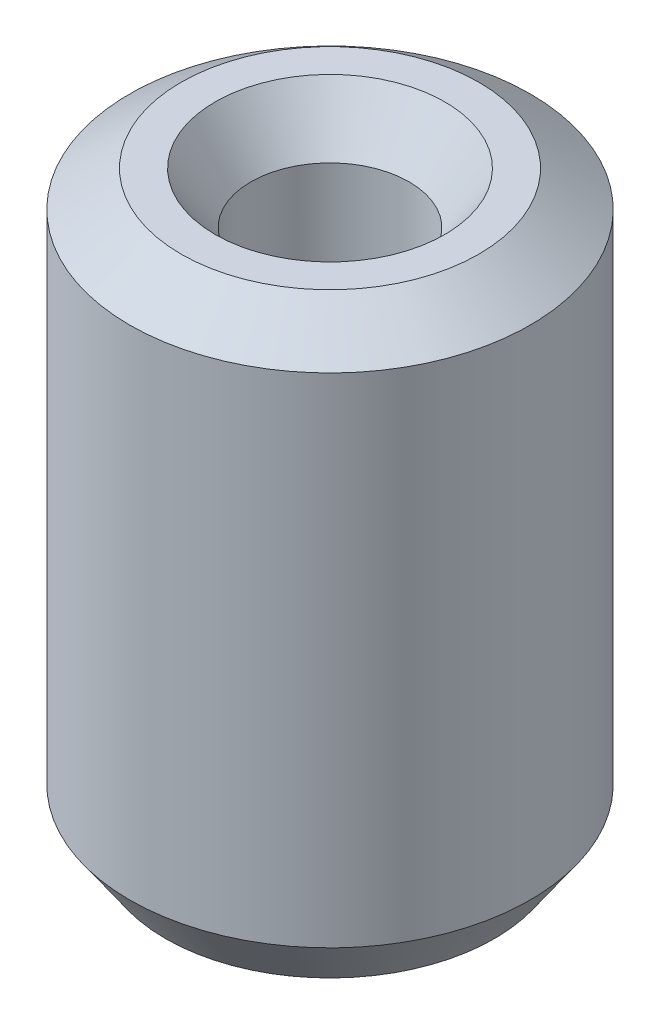
ISO-10303-21;
HEADER;
FILE_DESCRIPTION(('STEP AP214'),'2;1');
FILE_NAME('part.step','',(''),(''),'','','');
FILE_SCHEMA(('AUTOMOTIVE_DESIGN { 1 0 10303 214 1 1 1 1 }'));
ENDSEC;
DATA;
#1=APPLICATION_CONTEXT('core data for automotive mechanical design processes');
#2=APPLICATION_PROTOCOL_DEFINITION('international standard','automotive_design',2000,#1);
#3=PRODUCT_CONTEXT('',#1,'mechanical');
#4=PRODUCT('Part','Part','',(#3));
#5=PRODUCT_RELATED_PRODUCT_CATEGORY('part','',(#4));
#6=PRODUCT_DEFINITION_FORMATION('','',#4);
#7=PRODUCT_DEFINITION_CONTEXT('part definition',#1,'design');
#8=PRODUCT_DEFINITION('design','',#6,#7);
#9=PRODUCT_DEFINITION_SHAPE('','',#8);
#10=(LENGTH_UNIT() NAMED_UNIT(*) SI_UNIT(.MILLI.,.METRE.));
#11=(NAMED_UNIT(*) PLANE_ANGLE_UNIT() SI_UNIT($,.RADIAN.));
#12=(NAMED_UNIT(*) SI_UNIT($,.STERADIAN.) SOLID_ANGLE_UNIT());
#13=UNCERTAINTY_MEASURE_WITH_UNIT(LENGTH_MEASURE(1.E-05),#10,'distance_accuracy_value','');
#14=(GEOMETRIC_REPRESENTATION_CONTEXT(3) GLOBAL_UNCERTAINTY_ASSIGNED_CONTEXT((#13)) GLOBAL_UNIT_ASSIGNED_CONTEXT((#10,
#11,#12)) REPRESENTATION_CONTEXT('',''));
#15=CARTESIAN_POINT('',(0.,0.,0.));
#16=DIRECTION('',(0.,0.,1.));
#17=DIRECTION('',(1.,0.,0.));
#18=AXIS2_PLACEMENT_3D('',#15,#16,#17);
#19=CARTESIAN_POINT('',(0.,29.2128205983832,0.));
#20=DIRECTION('',(0.,-1.,0.));
#21=DIRECTION('',(0.,0.,-1.));
#22=AXIS2_PLACEMENT_3D('',#19,#20,#21);
#23=CYLINDRICAL_SURFACE('',#22,10.);
#24=CARTESIAN_POINT('',(0.,2.5648094755214,0.));
#25=DIRECTION('',(0.,1.,0.));
#26=DIRECTION('',(0.,0.,1.));
#27=AXIS2_PLACEMENT_3D('',#24,#25,#26);
#28=CIRCLE('',#27,10.);
#29=CARTESIAN_POINT('',(0.,2.5648094755214,-10.));
#30=VERTEX_POINT('',#29);
#31=EDGE_CURVE('E10',#30,#30,#28,.T.);
#32=CARTESIAN_POINT('',(0.,27.4273046035939,0.));
#33=DIRECTION('',(0.,1.,0.));
#34=DIRECTION('',(0.,0.,1.));
#35=AXIS2_PLACEMENT_3D('',#32,#33,#34);
#36=CIRCLE('',#35,10.);
#37=CARTESIAN_POINT('',(0.,27.4273046035939,-10.));
#38=VERTEX_POINT('',#37);
#39=EDGE_CURVE('E50',#38,#38,#36,.F.);
#40=CARTESIAN_POINT('',(0.,2.5648094755214,-10.));
#41=CARTESIAN_POINT('',(0.,2.82379379977216,-10.));
#42=CARTESIAN_POINT('',(0.,3.08277812402291,-10.));
#43=CARTESIAN_POINT('',(0.,3.60074677252442,-10.));
#44=CARTESIAN_POINT('',(0.,3.85973109677518,-10.));
#45=CARTESIAN_POINT('',(0.,4.37769974527669,-10.));
#46=CARTESIAN_POINT('',(0.,4.63668406952744,-10.));
#47=CARTESIAN_POINT('',(0.,5.15465271802895,-10.));
#48=CARTESIAN_POINT('',(0.,5.41363704227971,-10.));
#49=CARTESIAN_POINT('',(0.,5.93160569078122,-10.));
#50=CARTESIAN_POINT('',(0.,6.19059001503198,-10.));
#51=CARTESIAN_POINT('',(0.,6.70855866353349,-10.));
#52=CARTESIAN_POINT('',(0.,6.96754298778424,-10.));
#53=CARTESIAN_POINT('',(0.,7.48551163628575,-10.));
#54=CARTESIAN_POINT('',(0.,7.74449596053651,-10.));
#55=CARTESIAN_POINT('',(0.,8.26246460903802,-10.));
#56=CARTESIAN_POINT('',(0.,8.52144893328877,-10.));
#57=CARTESIAN_POINT('',(0.,9.03941758179028,-10.));
#58=CARTESIAN_POINT('',(0.,9.29840190604104,-10.));
#59=CARTESIAN_POINT('',(0.,9.81637055454255,-10.));
#60=CARTESIAN_POINT('',(0.,10.0753548787933,-10.));
#61=CARTESIAN_POINT('',(0.,10.5933235272948,-10.));
#62=CARTESIAN_POINT('',(0.,10.8523078515456,-10.));
#63=CARTESIAN_POINT('',(0.,11.3702765000471,-10.));
#64=CARTESIAN_POINT('',(0.,11.6292608242978,-10.));
#65=CARTESIAN_POINT('',(0.,12.1472294727993,-10.));
#66=CARTESIAN_POINT('',(0.,12.4062137970501,-10.));
#67=CARTESIAN_POINT('',(0.,12.9241824455516,-10.));
#68=CARTESIAN_POINT('',(0.,13.1831667698024,-10.));
#69=CARTESIAN_POINT('',(0.,13.7011354183039,-10.));
#70=CARTESIAN_POINT('',(0.,13.9601197425546,-10.));
#71=CARTESIAN_POINT('',(0.,14.4780883910561,-10.));
#72=CARTESIAN_POINT('',(0.,14.7370727153069,-10.));
#73=CARTESIAN_POINT('',(0.,15.2550413638084,-10.));
#74=CARTESIAN_POINT('',(0.,15.5140256880592,-10.));
#75=CARTESIAN_POINT('',(0.,16.0319943365607,-10.));
#76=CARTESIAN_POINT('',(0.,16.2909786608114,-10.));
#77=CARTESIAN_POINT('',(0.,16.8089473093129,-10.));
#78=CARTESIAN_POINT('',(0.,17.0679316335637,-10.));
#79=CARTESIAN_POINT('',(0.,17.5859002820652,-10.));
#80=CARTESIAN_POINT('',(0.,17.844884606316,-10.));
#81=CARTESIAN_POINT('',(0.,18.3628532548175,-10.));
#82=CARTESIAN_POINT('',(0.,18.6218375790682,-10.));
#83=CARTESIAN_POINT('',(0.,19.1398062275697,-10.));
#84=CARTESIAN_POINT('',(0.,19.3987905518205,-10.));
#85=CARTESIAN_POINT('',(0.,19.916759200322,-10.));
#86=CARTESIAN_POINT('',(0.,20.1757435245728,-10.));
#87=CARTESIAN_POINT('',(0.,20.6937121730743,-10.));
#88=CARTESIAN_POINT('',(0.,20.952696497325,-10.));
#89=CARTESIAN_POINT('',(0.,21.4706651458265,-10.));
#90=CARTESIAN_POINT('',(0.,21.7296494700773,-10.));
#91=CARTESIAN_POINT('',(0.,22.2476181185788,-10.));
#92=CARTESIAN_POINT('',(0.,22.5066024428296,-10.));
#93=CARTESIAN_POINT('',(0.,23.0245710913311,-10.));
#94=CARTESIAN_POINT('',(0.,23.2835554155818,-10.));
#95=CARTESIAN_POINT('',(0.,23.8015240640833,-10.));
#96=CARTESIAN_POINT('',(0.,24.0605083883341,-10.));
#97=CARTESIAN_POINT('',(0.,24.5784770368356,-10.));
#98=CARTESIAN_POINT('',(0.,24.8374613610864,-10.));
#99=CARTESIAN_POINT('',(0.,25.3554300095879,-10.));
#100=CARTESIAN_POINT('',(0.,25.6144143338386,-10.));
#101=CARTESIAN_POINT('',(0.,26.1323829823401,-10.));
#102=CARTESIAN_POINT('',(0.,26.3913673065909,-10.));
#103=CARTESIAN_POINT('',(0.,26.9093359550924,-10.));
#104=CARTESIAN_POINT('',(0.,27.1683202793432,-10.));
#105=CARTESIAN_POINT('',(0.,27.4273046035939,-10.));
#106=B_SPLINE_CURVE_WITH_KNOTS('',3,(#40,#41,#42,#43,#44,#45,#46,#47,#48,#49,#50,#51,#52,#53,
#54,#55,#56,#57,#58,#59,#60,#61,#62,#63,#64,#65,#66,#67,#68,#69,#70,#71,#72,#73,#74,#75,#76,#77,
#78,#79,#80,#81,#82,#83,#84,#85,#86,#87,#88,#89,#90,#91,#92,#93,#94,#95,#96,#97,#98,#99,#100,
#101,#102,#103,#104,#105),.UNSPECIFIED.,.F.,.F.,(4,2,2,2,2,2,2,2,2,2,2,2,2,2,2,2,2,2,2,2,2,2,2,
2,2,2,2,2,2,2,2,2,4),(0.,0.776952972752265,1.55390594550453,2.3308589182568,3.10781189100906,
3.88476486376133,4.6617178365136,5.43867080926586,6.21562378201813,6.99257675477039,
7.76952972752266,8.54648270027493,9.32343567302719,10.1003886457795,10.8773416185317,
11.654294591284,12.4312475640363,13.2082005367885,13.9851535095408,14.762106482293,
15.5390594550453,16.3160124277976,17.0929654005499,17.8699183733021,18.6468713460544,
19.4238243188066,20.2007772915589,20.9777302643112,21.7546832370634,22.5316362098157,
23.308589182568,24.0855421553202,24.8624951280725),.UNSPECIFIED.);
#107=EDGE_CURVE('BSEAM39',#30,#38,#106,.T.);
#108=ORIENTED_EDGE('',*,*,#31,.T.);
#109=ORIENTED_EDGE('',*,*,#39,.T.);
#110=ORIENTED_EDGE('',*,*,#107,.T.);
#111=ORIENTED_EDGE('',*,*,#107,.F.);
#112=EDGE_LOOP('',(#108,#110,#109,#111));
#113=FACE_BOUND('',#112,.T.);
#114=ADVANCED_FACE('F39',(#113),#23,.T.);
#115=CARTESIAN_POINT('',(0.,29.2128205983832,0.));
#116=DIRECTION('',(0.,1.,0.));
#117=DIRECTION('',(0.,0.,1.));
#118=AXIS2_PLACEMENT_3D('',#115,#116,#117);
#119=PLANE('',#118);
#120=CARTESIAN_POINT('',(0.,29.2128205983832,0.));
#121=DIRECTION('',(0.,1.,0.));
#122=DIRECTION('',(0.,0.,1.));
#123=AXIS2_PLACEMENT_3D('',#120,#121,#122);
#124=CIRCLE('',#123,5.73672593289727);
#125=CARTESIAN_POINT('',(0.,29.2128205983832,5.73672593289727));
#126=VERTEX_POINT('',#125);
#127=EDGE_CURVE('E58',#126,#126,#124,.F.);
#128=ORIENTED_EDGE('',*,*,#127,.T.);
#129=EDGE_LOOP('',(#128));
#130=FACE_BOUND('',#129,.T.);
#131=CARTESIAN_POINT('',(0.,29.2128205983832,0.));
#132=DIRECTION('',(0.,1.,0.));
#133=DIRECTION('',(0.,0.,1.));
#134=AXIS2_PLACEMENT_3D('',#131,#132,#133);
#135=CIRCLE('',#134,7.43519052447868);
#136=CARTESIAN_POINT('',(0.,29.2128205983832,7.43519052447868));
#137=VERTEX_POINT('',#136);
#138=EDGE_CURVE('E61',#137,#137,#135,.T.);
#139=ORIENTED_EDGE('',*,*,#138,.T.);
#140=EDGE_LOOP('',(#139));
#141=FACE_BOUND('',#140,.T.);
#142=ADVANCED_FACE('F88',(#130,#141),#119,.T.);
#143=CARTESIAN_POINT('',(0.,0.,0.));
#144=DIRECTION('',(0.,1.,0.));
#145=DIRECTION('',(0.,0.,1.));
#146=AXIS2_PLACEMENT_3D('',#143,#144,#145);
#147=PLANE('',#146);
#148=CARTESIAN_POINT('',(0.,0.,0.));
#149=DIRECTION('',(0.,1.,0.));
#150=DIRECTION('',(0.,0.,1.));
#151=AXIS2_PLACEMENT_3D('',#148,#149,#150);
#152=CIRCLE('',#151,6.51601941362921);
#153=CARTESIAN_POINT('',(0.,0.,6.51601941362921));
#154=VERTEX_POINT('',#153);
#155=EDGE_CURVE('E51',#154,#154,#152,.T.);
#156=ORIENTED_EDGE('',*,*,#155,.T.);
#157=EDGE_LOOP('',(#156));
#158=FACE_BOUND('',#157,.T.);
#159=CARTESIAN_POINT('',(0.,0.,0.));
#160=DIRECTION('',(0.,1.,0.));
#161=DIRECTION('',(0.,0.,1.));
#162=AXIS2_PLACEMENT_3D('',#159,#160,#161);
#163=CIRCLE('',#162,8.2144840052106);
#164=CARTESIAN_POINT('',(0.,0.,8.2144840052106));
#165=VERTEX_POINT('',#164);
#166=EDGE_CURVE('E54',#165,#165,#163,.F.);
#167=ORIENTED_EDGE('',*,*,#166,.T.);
#168=EDGE_LOOP('',(#167));
#169=FACE_BOUND('',#168,.T.);
#170=ADVANCED_FACE('F83',(#158,#169),#147,.F.);
#171=CARTESIAN_POINT('',(0.,29.2128205983832,0.));
#172=DIRECTION('',(0.,-1.,0.));
#173=DIRECTION('',(0.,0.,-1.));
#174=AXIS2_PLACEMENT_3D('',#171,#172,#173);
#175=CYLINDRICAL_SURFACE('',#174,3.95120993810789);
#176=CARTESIAN_POINT('',(0.,26.6480111228619,0.));
#177=DIRECTION('',(0.,1.,0.));
#178=DIRECTION('',(0.,0.,1.));
#179=AXIS2_PLACEMENT_3D('',#176,#177,#178);
#180=CIRCLE('',#179,3.95120993810789);
#181=CARTESIAN_POINT('',(0.,26.6480111228619,-3.95120993810789));
#182=VERTEX_POINT('',#181);
#183=EDGE_CURVE('E67',#182,#182,#180,.T.);
#184=CARTESIAN_POINT('',(0.,1.78551599478935,0.));
#185=DIRECTION('',(0.,1.,0.));
#186=DIRECTION('',(0.,0.,1.));
#187=AXIS2_PLACEMENT_3D('',#184,#185,#186);
#188=CIRCLE('',#187,3.95120993810789);
#189=CARTESIAN_POINT('',(0.,1.78551599478935,-3.95120993810789));
#190=VERTEX_POINT('',#189);
#191=EDGE_CURVE('E69',#190,#190,#188,.F.);
#192=CARTESIAN_POINT('',(0.,26.6480111228619,-3.95120993810789));
#193=CARTESIAN_POINT('',(0.,26.3890267986111,-3.95120993810789));
#194=CARTESIAN_POINT('',(0.,26.1300424743604,-3.95120993810789));
#195=CARTESIAN_POINT('',(0.,25.6120738258589,-3.95120993810789));
#196=CARTESIAN_POINT('',(0.,25.3530895016081,-3.95120993810789));
#197=CARTESIAN_POINT('',(0.,24.8351208531066,-3.95120993810789));
#198=CARTESIAN_POINT('',(0.,24.5761365288558,-3.95120993810789));
#199=CARTESIAN_POINT('',(0.,24.0581678803543,-3.95120993810789));
#200=CARTESIAN_POINT('',(0.,23.7991835561036,-3.95120993810789));
#201=CARTESIAN_POINT('',(0.,23.2812149076021,-3.95120993810789));
#202=CARTESIAN_POINT('',(0.,23.0222305833513,-3.95120993810789));
#203=CARTESIAN_POINT('',(0.,22.5042619348498,-3.95120993810789));
#204=CARTESIAN_POINT('',(0.,22.245277610599,-3.95120993810789));
#205=CARTESIAN_POINT('',(0.,21.7273089620975,-3.95120993810789));
#206=CARTESIAN_POINT('',(0.,21.4683246378468,-3.95120993810789));
#207=CARTESIAN_POINT('',(0.,20.9503559893453,-3.95120993810789));
#208=CARTESIAN_POINT('',(0.,20.6913716650945,-3.95120993810789));
#209=CARTESIAN_POINT('',(0.,20.173403016593,-3.95120993810789));
#210=CARTESIAN_POINT('',(0.,19.9144186923422,-3.95120993810789));
#211=CARTESIAN_POINT('',(0.,19.3964500438407,-3.95120993810789));
#212=CARTESIAN_POINT('',(0.,19.13746571959,-3.95120993810789));
#213=CARTESIAN_POINT('',(0.,18.6194970710885,-3.95120993810789));
#214=CARTESIAN_POINT('',(0.,18.3605127468377,-3.95120993810789));
#215=CARTESIAN_POINT('',(0.,17.8425440983362,-3.95120993810789));
#216=CARTESIAN_POINT('',(0.,17.5835597740854,-3.95120993810789));
#217=CARTESIAN_POINT('',(0.,17.0655911255839,-3.95120993810789));
#218=CARTESIAN_POINT('',(0.,16.8066068013332,-3.95120993810789));
#219=CARTESIAN_POINT('',(0.,16.2886381528317,-3.95120993810789));
#220=CARTESIAN_POINT('',(0.,16.0296538285809,-3.95120993810789));
#221=CARTESIAN_POINT('',(0.,15.5116851800794,-3.95120993810789));
#222=CARTESIAN_POINT('',(0.,15.2527008558286,-3.95120993810789));
#223=CARTESIAN_POINT('',(0.,14.7347322073271,-3.95120993810789));
#224=CARTESIAN_POINT('',(0.,14.4757478830764,-3.95120993810789));
#225=CARTESIAN_POINT('',(0.,13.9577792345749,-3.95120993810789));
#226=CARTESIAN_POINT('',(0.,13.6987949103241,-3.95120993810789));
#227=CARTESIAN_POINT('',(0.,13.1808262618226,-3.95120993810789));
#228=CARTESIAN_POINT('',(0.,12.9218419375718,-3.95120993810789));
#229=CARTESIAN_POINT('',(0.,12.4038732890703,-3.95120993810789));
#230=CARTESIAN_POINT('',(0.,12.1448889648196,-3.95120993810789));
#231=CARTESIAN_POINT('',(0.,11.6269203163181,-3.95120993810789));
#232=CARTESIAN_POINT('',(0.,11.3679359920673,-3.95120993810789));
#233=CARTESIAN_POINT('',(0.,10.8499673435658,-3.95120993810789));
#234=CARTESIAN_POINT('',(0.,10.590983019315,-3.95120993810789));
#235=CARTESIAN_POINT('',(0.,10.0730143708135,-3.95120993810789));
#236=CARTESIAN_POINT('',(0.,9.81403004656278,-3.95120993810789));
#237=CARTESIAN_POINT('',(0.,9.29606139806126,-3.95120993810789));
#238=CARTESIAN_POINT('',(0.,9.03707707381051,-3.95120993810789));
#239=CARTESIAN_POINT('',(0.,8.51910842530899,-3.95120993810789));
#240=CARTESIAN_POINT('',(0.,8.26012410105824,-3.95120993810789));
#241=CARTESIAN_POINT('',(0.,7.74215545255673,-3.95120993810789));
#242=CARTESIAN_POINT('',(0.,7.48317112830597,-3.95120993810789));
#243=CARTESIAN_POINT('',(0.,6.96520247980446,-3.95120993810789));
#244=CARTESIAN_POINT('',(0.,6.7062181555537,-3.95120993810789));
#245=CARTESIAN_POINT('',(0.,6.18824950705219,-3.95120993810789));
#246=CARTESIAN_POINT('',(0.,5.92926518280144,-3.95120993810789));
#247=CARTESIAN_POINT('',(0.,5.41129653429993,-3.95120993810789));
#248=CARTESIAN_POINT('',(0.,5.15231221004917,-3.95120993810789));
#249=CARTESIAN_POINT('',(0.,4.63434356154766,-3.95120993810789));
#250=CARTESIAN_POINT('',(0.,4.37535923729691,-3.95120993810789));
#251=CARTESIAN_POINT('',(0.,3.85739058879539,-3.95120993810789));
#252=CARTESIAN_POINT('',(0.,3.59840626454464,-3.95120993810789));
#253=CARTESIAN_POINT('',(0.,3.08043761604312,-3.95120993810789));
#254=CARTESIAN_POINT('',(0.,2.82145329179237,-3.95120993810789));
#255=CARTESIAN_POINT('',(0.,2.30348464329086,-3.95120993810789));
#256=CARTESIAN_POINT('',(0.,2.0445003190401,-3.95120993810789));
#257=CARTESIAN_POINT('',(0.,1.78551599478935,-3.95120993810789));
#258=B_SPLINE_CURVE_WITH_KNOTS('',3,(#192,#193,#194,#195,#196,#197,#198,#199,#200,#201,#202,
#203,#204,#205,#206,#207,#208,#209,#210,#211,#212,#213,#214,#215,#216,#217,#218,#219,#220,#221,
#222,#223,#224,#225,#226,#227,#228,#229,#230,#231,#232,#233,#234,#235,#236,#237,#238,#239,#240,
#241,#242,#243,#244,#245,#246,#247,#248,#249,#250,#251,#252,#253,#254,#255,#256,#257),
.UNSPECIFIED.,.F.,.F.,(4,2,2,2,2,2,2,2,2,2,2,2,2,2,2,2,2,2,2,2,2,2,2,2,2,2,2,2,2,2,2,2,4),(0.,
0.776952972752268,1.55390594550453,2.3308589182568,3.10781189100907,3.88476486376134,
4.6617178365136,5.43867080926587,6.21562378201814,6.9925767547704,7.76952972752267,
8.54648270027494,9.32343567302721,10.1003886457795,10.8773416185317,11.654294591284,
12.4312475640363,13.2082005367885,13.9851535095408,14.7621064822931,15.5390594550453,
16.3160124277976,17.0929654005499,17.8699183733021,18.6468713460544,19.4238243188067,
20.2007772915589,20.9777302643112,21.7546832370635,22.5316362098157,23.308589182568,
24.0855421553203,24.8624951280725),.UNSPECIFIED.);
#259=EDGE_CURVE('BSEAM71',#182,#190,#258,.T.);
#260=ORIENTED_EDGE('',*,*,#183,.T.);
#261=ORIENTED_EDGE('',*,*,#191,.T.);
#262=ORIENTED_EDGE('',*,*,#259,.T.);
#263=ORIENTED_EDGE('',*,*,#259,.F.);
#264=EDGE_LOOP('',(#260,#262,#261,#263));
#265=FACE_BOUND('',#264,.T.);
#266=ADVANCED_FACE('F71',(#265),#175,.F.);
#267=CARTESIAN_POINT('',(0.,26.6480111228619,0.));
#268=DIRECTION('',(0.,1.,0.));
#269=DIRECTION('',(0.,0.,1.));
#270=AXIS2_PLACEMENT_3D('',#267,#268,#269);
#271=CONICAL_SURFACE('',#270,3.95120993810789,0.608143666459102);
#272=ORIENTED_EDGE('',*,*,#127,.F.);
#273=EDGE_LOOP('',(#272));
#274=FACE_BOUND('',#273,.T.);
#275=ORIENTED_EDGE('',*,*,#183,.F.);
#276=EDGE_LOOP('',(#275));
#277=FACE_BOUND('',#276,.T.);
#278=ADVANCED_FACE('F77',(#274,#277),#271,.F.);
#279=CARTESIAN_POINT('',(0.,0.,0.));
#280=DIRECTION('',(0.,-1.,0.));
#281=DIRECTION('',(0.,0.,-1.));
#282=AXIS2_PLACEMENT_3D('',#279,#280,#281);
#283=CONICAL_SURFACE('',#282,6.51601941362921,0.962652660335794);
#284=ORIENTED_EDGE('',*,*,#191,.F.);
#285=EDGE_LOOP('',(#284));
#286=FACE_BOUND('',#285,.T.);
#287=ORIENTED_EDGE('',*,*,#155,.F.);
#288=EDGE_LOOP('',(#287));
#289=FACE_BOUND('',#288,.T.);
#290=ADVANCED_FACE('F73',(#286,#289),#283,.F.);
#291=CARTESIAN_POINT('',(0.,2.5648094755214,0.));
#292=DIRECTION('',(0.,1.,0.));
#293=DIRECTION('',(0.,0.,1.));
#294=AXIS2_PLACEMENT_3D('',#291,#292,#293);
#295=CONICAL_SURFACE('',#294,10.,0.6081436664591);
#296=ORIENTED_EDGE('',*,*,#166,.F.);
#297=EDGE_LOOP('',(#296));
#298=FACE_BOUND('',#297,.T.);
#299=ORIENTED_EDGE('',*,*,#31,.F.);
#300=EDGE_LOOP('',(#299));
#301=FACE_BOUND('',#300,.T.);
#302=ADVANCED_FACE('F76',(#298,#301),#295,.T.);
#303=CARTESIAN_POINT('',(0.,29.2128205983832,0.));
#304=DIRECTION('',(0.,-1.,0.));
#305=DIRECTION('',(0.,0.,-1.));
#306=AXIS2_PLACEMENT_3D('',#303,#304,#305);
#307=CONICAL_SURFACE('',#306,7.43519052447868,0.962652660335798);
#308=ORIENTED_EDGE('',*,*,#39,.F.);
#309=EDGE_LOOP('',(#308));
#310=FACE_BOUND('',#309,.T.);
#311=ORIENTED_EDGE('',*,*,#138,.F.);
#312=EDGE_LOOP('',(#311));
#313=FACE_BOUND('',#312,.T.);
#314=ADVANCED_FACE('F45',(#310,#313),#307,.T.);
#315=CLOSED_SHELL('',(#114,#142,#170,#266,#278,#290,#302,#314));
#316=MANIFOLD_SOLID_BREP('B2',#315);
#317=ADVANCED_BREP_SHAPE_REPRESENTATION('',(#18,#316),#14);
#318=SHAPE_DEFINITION_REPRESENTATION(#9,#317);
ENDSEC;
END-ISO-10303-21;
